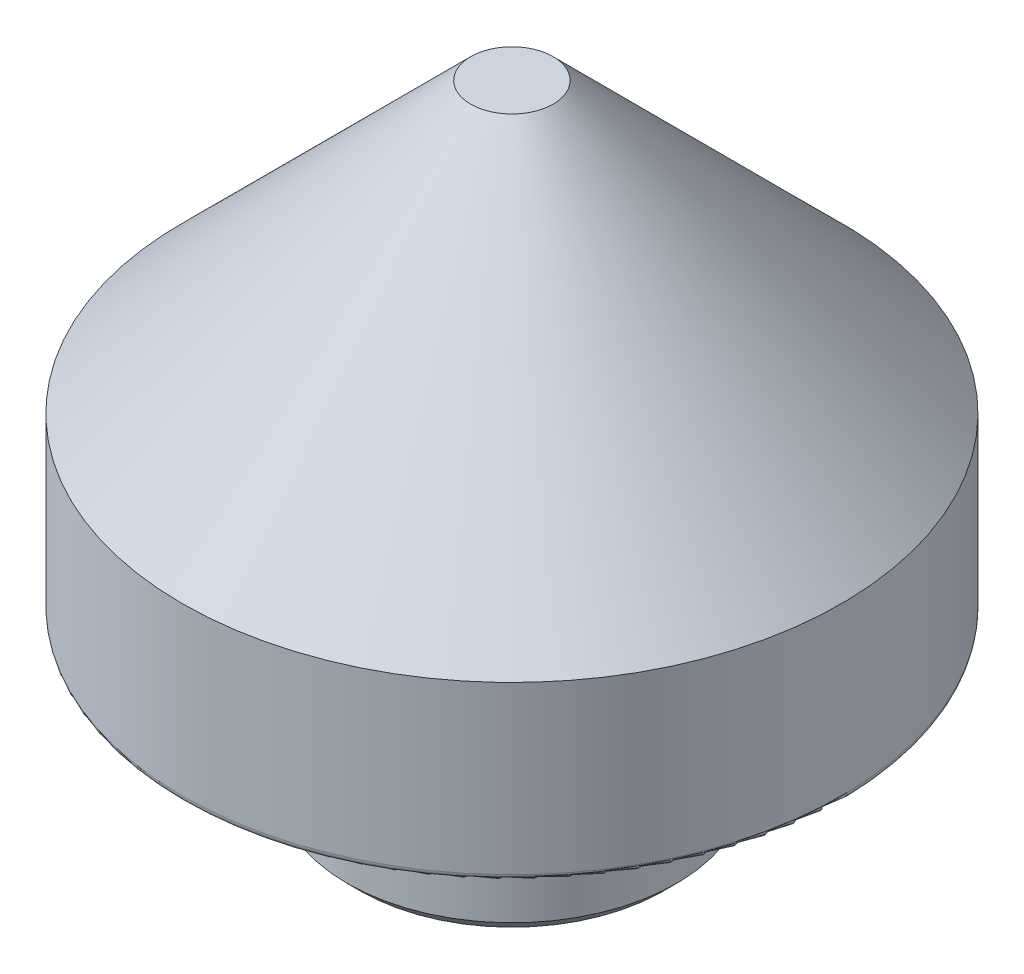
ISO-10303-21;
HEADER;
FILE_DESCRIPTION(('STEP AP214'),'2;1');
FILE_NAME('part.step','',(''),(''),'','','');
FILE_SCHEMA(('AUTOMOTIVE_DESIGN { 1 0 10303 214 1 1 1 1 }'));
ENDSEC;
DATA;
#1=APPLICATION_CONTEXT('core data for automotive mechanical design processes');
#2=APPLICATION_PROTOCOL_DEFINITION('international standard','automotive_design',2000,#1);
#3=PRODUCT_CONTEXT('',#1,'mechanical');
#4=PRODUCT('Part','Part','',(#3));
#5=PRODUCT_RELATED_PRODUCT_CATEGORY('part','',(#4));
#6=PRODUCT_DEFINITION_FORMATION('','',#4);
#7=PRODUCT_DEFINITION_CONTEXT('part definition',#1,'design');
#8=PRODUCT_DEFINITION('design','',#6,#7);
#9=PRODUCT_DEFINITION_SHAPE('','',#8);
#10=(LENGTH_UNIT() NAMED_UNIT(*) SI_UNIT(.MILLI.,.METRE.));
#11=(NAMED_UNIT(*) PLANE_ANGLE_UNIT() SI_UNIT($,.RADIAN.));
#12=(NAMED_UNIT(*) SI_UNIT($,.STERADIAN.) SOLID_ANGLE_UNIT());
#13=UNCERTAINTY_MEASURE_WITH_UNIT(LENGTH_MEASURE(1.E-05),#10,'distance_accuracy_value','');
#14=(GEOMETRIC_REPRESENTATION_CONTEXT(3) GLOBAL_UNCERTAINTY_ASSIGNED_CONTEXT((#13)) GLOBAL_UNIT_ASSIGNED_CONTEXT((#10,
#11,#12)) REPRESENTATION_CONTEXT('',''));
#15=CARTESIAN_POINT('',(0.,0.,0.));
#16=DIRECTION('',(0.,0.,1.));
#17=DIRECTION('',(1.,0.,0.));
#18=AXIS2_PLACEMENT_3D('',#15,#16,#17);
#19=CARTESIAN_POINT('',(12.7,0.,0.));
#20=DIRECTION('',(0.,1.,0.));
#21=DIRECTION('',(0.,0.,1.));
#22=AXIS2_PLACEMENT_3D('',#19,#20,#21);
#23=PLANE('',#22);
#24=CARTESIAN_POINT('',(0.,0.,0.));
#25=DIRECTION('',(0.,1.,0.));
#26=DIRECTION('',(0.,0.,1.));
#27=AXIS2_PLACEMENT_3D('',#24,#25,#26);
#28=CIRCLE('',#27,12.446);
#29=CARTESIAN_POINT('',(0.,0.,12.446));
#30=VERTEX_POINT('',#29);
#31=EDGE_CURVE('E11',#30,#30,#28,.F.);
#32=ORIENTED_EDGE('',*,*,#31,.T.);
#33=EDGE_LOOP('',(#32));
#34=FACE_BOUND('',#33,.T.);
#35=CARTESIAN_POINT('',(0.,0.,0.));
#36=DIRECTION('',(0.,1.,0.));
#37=DIRECTION('',(0.,0.,1.));
#38=AXIS2_PLACEMENT_3D('',#35,#36,#37);
#39=CIRCLE('',#38,7.42596126628495);
#40=CARTESIAN_POINT('',(0.,0.,7.42596126628495));
#41=VERTEX_POINT('',#40);
#42=EDGE_CURVE('E61',#41,#41,#39,.F.);
#43=ORIENTED_EDGE('',*,*,#42,.F.);
#44=EDGE_LOOP('',(#43));
#45=FACE_BOUND('',#44,.T.);
#46=ADVANCED_FACE('F33',(#34,#45),#23,.F.);
#47=CARTESIAN_POINT('',(0.,35.2893442622951,0.));
#48=DIRECTION('',(0.,1.,0.));
#49=DIRECTION('',(0.,0.,1.));
#50=AXIS2_PLACEMENT_3D('',#47,#48,#49);
#51=CYLINDRICAL_SURFACE('',#50,12.7);
#52=CARTESIAN_POINT('',(0.,0.253999999999997,0.));
#53=DIRECTION('',(0.,1.,0.));
#54=DIRECTION('',(0.,0.,1.));
#55=AXIS2_PLACEMENT_3D('',#52,#53,#54);
#56=CIRCLE('',#55,12.7);
#57=CARTESIAN_POINT('',(0.,0.253999999999997,12.7));
#58=VERTEX_POINT('',#57);
#59=EDGE_CURVE('E40',#58,#58,#56,.T.);
#60=ORIENTED_EDGE('',*,*,#59,.T.);
#61=EDGE_LOOP('',(#60));
#62=FACE_BOUND('',#61,.T.);
#63=CARTESIAN_POINT('',(0.,6.66750000000004,0.));
#64=DIRECTION('',(0.,1.,0.));
#65=DIRECTION('',(0.,0.,1.));
#66=AXIS2_PLACEMENT_3D('',#63,#64,#65);
#67=CIRCLE('',#66,12.7);
#68=CARTESIAN_POINT('',(0.,6.66750000000004,12.7));
#69=VERTEX_POINT('',#68);
#70=EDGE_CURVE('E64',#69,#69,#67,.T.);
#71=ORIENTED_EDGE('',*,*,#70,.F.);
#72=EDGE_LOOP('',(#71));
#73=FACE_BOUND('',#72,.T.);
#74=ADVANCED_FACE('F35',(#62,#73),#51,.T.);
#75=CARTESIAN_POINT('',(0.,17.78,0.));
#76=DIRECTION('',(0.,-1.,0.));
#77=DIRECTION('',(0.,0.,-1.));
#78=AXIS2_PLACEMENT_3D('',#75,#76,#77);
#79=PLANE('',#78);
#80=CARTESIAN_POINT('',(0.,17.78,0.));
#81=DIRECTION('',(0.,1.,0.));
#82=DIRECTION('',(0.,0.,1.));
#83=AXIS2_PLACEMENT_3D('',#80,#81,#82);
#84=CIRCLE('',#83,1.5875);
#85=CARTESIAN_POINT('',(0.,17.78,1.5875));
#86=VERTEX_POINT('',#85);
#87=EDGE_CURVE('E67',#86,#86,#84,.T.);
#88=ORIENTED_EDGE('',*,*,#87,.T.);
#89=EDGE_LOOP('',(#88));
#90=FACE_BOUND('',#89,.T.);
#91=ADVANCED_FACE('F103',(#90),#79,.F.);
#92=CARTESIAN_POINT('',(0.,6.66750000000004,0.));
#93=DIRECTION('',(0.,-1.,0.));
#94=DIRECTION('',(0.,0.,-1.));
#95=AXIS2_PLACEMENT_3D('',#92,#93,#94);
#96=CONICAL_SURFACE('',#95,12.7,0.78539816339745);
#97=ORIENTED_EDGE('',*,*,#87,.F.);
#98=EDGE_LOOP('',(#97));
#99=FACE_BOUND('',#98,.T.);
#100=ORIENTED_EDGE('',*,*,#70,.T.);
#101=EDGE_LOOP('',(#100));
#102=FACE_BOUND('',#101,.T.);
#103=ADVANCED_FACE('F116',(#99,#102),#96,.T.);
#104=CARTESIAN_POINT('',(0.,-0.508,0.));
#105=DIRECTION('',(0.,1.,0.));
#106=DIRECTION('',(0.,0.,1.));
#107=AXIS2_PLACEMENT_3D('',#104,#105,#106);
#108=TOROIDAL_SURFACE('',#107,6.85800000000001,0.761999999999999);
#109=CARTESIAN_POINT('',(0.,-1.07596126628495,0.));
#110=DIRECTION('',(0.,1.,0.));
#111=DIRECTION('',(0.,0.,1.));
#112=AXIS2_PLACEMENT_3D('',#109,#110,#111);
#113=CIRCLE('',#112,6.35000000000001);
#114=CARTESIAN_POINT('',(0.,-1.07596126628495,6.35000000000001));
#115=VERTEX_POINT('',#114);
#116=EDGE_CURVE('E60',#115,#115,#113,.T.);
#117=ORIENTED_EDGE('',*,*,#116,.T.);
#118=EDGE_LOOP('',(#117));
#119=FACE_BOUND('',#118,.T.);
#120=ORIENTED_EDGE('',*,*,#42,.T.);
#121=EDGE_LOOP('',(#120));
#122=FACE_BOUND('',#121,.T.);
#123=ADVANCED_FACE('F112',(#119,#122),#108,.F.);
#124=CARTESIAN_POINT('',(6.35000000000001,-6.35,0.));
#125=DIRECTION('',(0.,1.,0.));
#126=DIRECTION('',(0.,0.,1.));
#127=AXIS2_PLACEMENT_3D('',#124,#125,#126);
#128=PLANE('',#127);
#129=CARTESIAN_POINT('',(0.,-6.35,0.));
#130=DIRECTION('',(0.,-1.,0.));
#131=DIRECTION('',(0.,0.,-1.));
#132=AXIS2_PLACEMENT_3D('',#129,#130,#131);
#133=CIRCLE('',#132,2.413);
#134=CARTESIAN_POINT('',(0.,-6.35,-2.413));
#135=VERTEX_POINT('',#134);
#136=EDGE_CURVE('E55',#135,#135,#133,.T.);
#137=ORIENTED_EDGE('',*,*,#136,.F.);
#138=EDGE_LOOP('',(#137));
#139=FACE_BOUND('',#138,.T.);
#140=CARTESIAN_POINT('',(0.,-6.35,0.));
#141=DIRECTION('',(0.,1.,0.));
#142=DIRECTION('',(0.,0.,1.));
#143=AXIS2_PLACEMENT_3D('',#140,#141,#142);
#144=CIRCLE('',#143,5.842);
#145=CARTESIAN_POINT('',(0.,-6.35,5.842));
#146=VERTEX_POINT('',#145);
#147=EDGE_CURVE('E75',#146,#146,#144,.F.);
#148=ORIENTED_EDGE('',*,*,#147,.T.);
#149=EDGE_LOOP('',(#148));
#150=FACE_BOUND('',#149,.T.);
#151=ADVANCED_FACE('F108',(#139,#150),#128,.F.);
#152=CARTESIAN_POINT('',(0.,35.2893442622951,0.));
#153=DIRECTION('',(0.,1.,0.));
#154=DIRECTION('',(0.,0.,1.));
#155=AXIS2_PLACEMENT_3D('',#152,#153,#154);
#156=CYLINDRICAL_SURFACE('',#155,6.35000000000001);
#157=CARTESIAN_POINT('',(0.,-5.842,0.));
#158=DIRECTION('',(0.,1.,0.));
#159=DIRECTION('',(0.,0.,1.));
#160=AXIS2_PLACEMENT_3D('',#157,#158,#159);
#161=CIRCLE('',#160,6.35000000000001);
#162=CARTESIAN_POINT('',(0.,-5.842,6.35000000000001));
#163=VERTEX_POINT('',#162);
#164=EDGE_CURVE('E70',#163,#163,#161,.T.);
#165=ORIENTED_EDGE('',*,*,#164,.T.);
#166=EDGE_LOOP('',(#165));
#167=FACE_BOUND('',#166,.T.);
#168=ORIENTED_EDGE('',*,*,#116,.F.);
#169=EDGE_LOOP('',(#168));
#170=FACE_BOUND('',#169,.T.);
#171=ADVANCED_FACE('F94',(#167,#170),#156,.T.);
#172=CARTESIAN_POINT('',(0.,-5.842,0.));
#173=DIRECTION('',(0.,1.,0.));
#174=DIRECTION('',(0.,0.,1.));
#175=AXIS2_PLACEMENT_3D('',#172,#173,#174);
#176=CONICAL_SURFACE('',#175,6.35000000000001,0.78539816339745);
#177=ORIENTED_EDGE('',*,*,#147,.F.);
#178=EDGE_LOOP('',(#177));
#179=FACE_BOUND('',#178,.T.);
#180=ORIENTED_EDGE('',*,*,#164,.F.);
#181=EDGE_LOOP('',(#180));
#182=FACE_BOUND('',#181,.T.);
#183=ADVANCED_FACE('F85',(#179,#182),#176,.T.);
#184=CARTESIAN_POINT('',(0.,0.253999999999997,0.));
#185=DIRECTION('',(0.,1.,0.));
#186=DIRECTION('',(0.,0.,1.));
#187=AXIS2_PLACEMENT_3D('',#184,#185,#186);
#188=TOROIDAL_SURFACE('',#187,12.446,0.254);
#189=ORIENTED_EDGE('',*,*,#31,.F.);
#190=EDGE_LOOP('',(#189));
#191=FACE_BOUND('',#190,.T.);
#192=ORIENTED_EDGE('',*,*,#59,.F.);
#193=EDGE_LOOP('',(#192));
#194=FACE_BOUND('',#193,.T.);
#195=ADVANCED_FACE('F82',(#191,#194),#188,.T.);
#196=CARTESIAN_POINT('',(0.,-6.35,0.));
#197=DIRECTION('',(0.,-1.,0.));
#198=DIRECTION('',(0.,0.,-1.));
#199=AXIS2_PLACEMENT_3D('',#196,#197,#198);
#200=CONICAL_SURFACE('',#199,2.413,0.785398163397446);
#201=CARTESIAN_POINT('',(0.,-5.95629999999999,0.));
#202=DIRECTION('',(0.,-1.,0.));
#203=DIRECTION('',(0.,0.,-1.));
#204=AXIS2_PLACEMENT_3D('',#201,#202,#203);
#205=CIRCLE('',#204,2.01929999999999);
#206=CARTESIAN_POINT('',(0.,-5.95629999999999,-2.01929999999999));
#207=VERTEX_POINT('',#206);
#208=EDGE_CURVE('E52',#207,#207,#205,.T.);
#209=ORIENTED_EDGE('',*,*,#208,.F.);
#210=EDGE_LOOP('',(#209));
#211=FACE_BOUND('',#210,.T.);
#212=ORIENTED_EDGE('',*,*,#136,.T.);
#213=EDGE_LOOP('',(#212));
#214=FACE_BOUND('',#213,.T.);
#215=ADVANCED_FACE('F84',(#211,#214),#200,.F.);
#216=CARTESIAN_POINT('',(0.,-6.35,0.));
#217=DIRECTION('',(0.,-1.,0.));
#218=DIRECTION('',(0.,0.,-1.));
#219=AXIS2_PLACEMENT_3D('',#216,#217,#218);
#220=CYLINDRICAL_SURFACE('',#219,2.01929999999999);
#221=CARTESIAN_POINT('',(0.,3.9624,0.));
#222=DIRECTION('',(0.,-1.,0.));
#223=DIRECTION('',(0.,0.,-1.));
#224=AXIS2_PLACEMENT_3D('',#221,#222,#223);
#225=CIRCLE('',#224,2.01929999999999);
#226=CARTESIAN_POINT('',(0.,3.9624,-2.01929999999999));
#227=VERTEX_POINT('',#226);
#228=EDGE_CURVE('E50',#227,#227,#225,.T.);
#229=ORIENTED_EDGE('',*,*,#228,.F.);
#230=EDGE_LOOP('',(#229));
#231=FACE_BOUND('',#230,.T.);
#232=ORIENTED_EDGE('',*,*,#208,.T.);
#233=EDGE_LOOP('',(#232));
#234=FACE_BOUND('',#233,.T.);
#235=ADVANCED_FACE('F46',(#231,#234),#220,.F.);
#236=CARTESIAN_POINT('',(0.,3.9624,0.));
#237=DIRECTION('',(0.,-1.,0.));
#238=DIRECTION('',(0.,0.,-1.));
#239=AXIS2_PLACEMENT_3D('',#236,#237,#238);
#240=CONICAL_SURFACE('',#239,2.01929999999999,1.02974425867665);
#241=CARTESIAN_POINT('',(0.,5.17571784800235,0.));
#242=VERTEX_POINT('',#241);
#243=VERTEX_LOOP('',#242);
#244=FACE_BOUND('',#243,.T.);
#245=ORIENTED_EDGE('',*,*,#228,.T.);
#246=EDGE_LOOP('',(#245));
#247=FACE_BOUND('',#246,.T.);
#248=ADVANCED_FACE('F43',(#244,#247),#240,.F.);
#249=CLOSED_SHELL('',(#46,#74,#91,#103,#123,#151,#171,#183,#195,#215,#235,#248));
#250=MANIFOLD_SOLID_BREP('B2',#249);
#251=ADVANCED_BREP_SHAPE_REPRESENTATION('',(#18,#250),#14);
#252=SHAPE_DEFINITION_REPRESENTATION(#9,#251);
ENDSEC;
END-ISO-10303-21;
